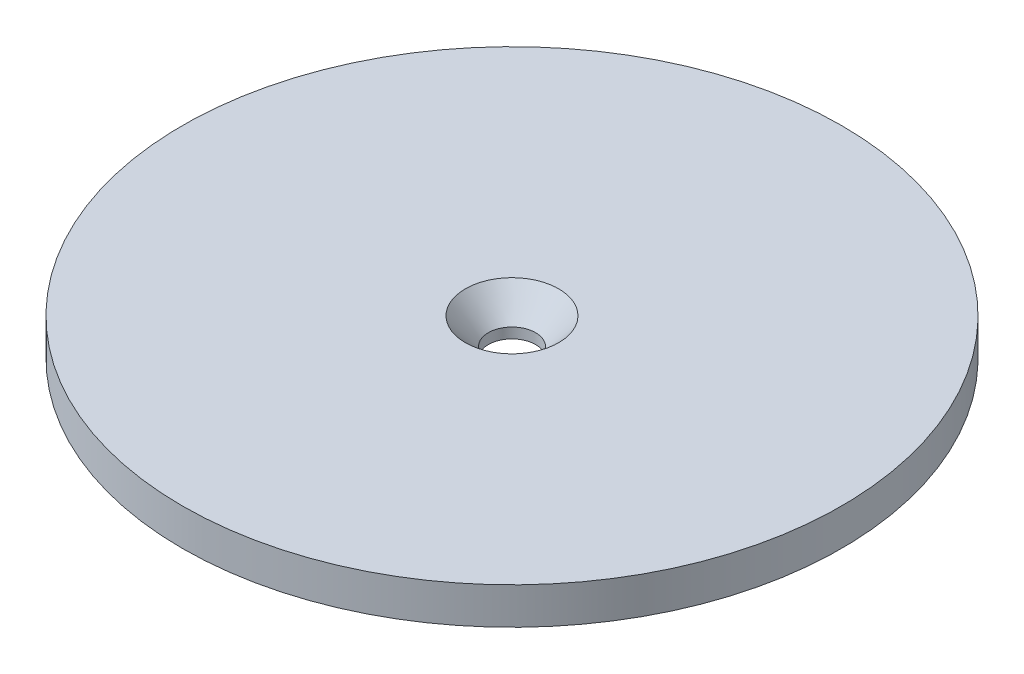
ISO-10303-21;
HEADER;
FILE_DESCRIPTION(('STEP AP214'),'2;1');
FILE_NAME('part.step','',(''),(''),'','','');
FILE_SCHEMA(('AUTOMOTIVE_DESIGN { 1 0 10303 214 1 1 1 1 }'));
ENDSEC;
DATA;
#1=APPLICATION_CONTEXT('core data for automotive mechanical design processes');
#2=APPLICATION_PROTOCOL_DEFINITION('international standard','automotive_design',2000,#1);
#3=PRODUCT_CONTEXT('',#1,'mechanical');
#4=PRODUCT('Part','Part','',(#3));
#5=PRODUCT_RELATED_PRODUCT_CATEGORY('part','',(#4));
#6=PRODUCT_DEFINITION_FORMATION('','',#4);
#7=PRODUCT_DEFINITION_CONTEXT('part definition',#1,'design');
#8=PRODUCT_DEFINITION('design','',#6,#7);
#9=PRODUCT_DEFINITION_SHAPE('','',#8);
#10=(LENGTH_UNIT() NAMED_UNIT(*) SI_UNIT(.MILLI.,.METRE.));
#11=(NAMED_UNIT(*) PLANE_ANGLE_UNIT() SI_UNIT($,.RADIAN.));
#12=(NAMED_UNIT(*) SI_UNIT($,.STERADIAN.) SOLID_ANGLE_UNIT());
#13=UNCERTAINTY_MEASURE_WITH_UNIT(LENGTH_MEASURE(1.E-05),#10,'distance_accuracy_value','');
#14=(GEOMETRIC_REPRESENTATION_CONTEXT(3) GLOBAL_UNCERTAINTY_ASSIGNED_CONTEXT((#13)) GLOBAL_UNIT_ASSIGNED_CONTEXT((#10,
#11,#12)) REPRESENTATION_CONTEXT('',''));
#15=CARTESIAN_POINT('',(0.,0.,0.));
#16=DIRECTION('',(0.,0.,1.));
#17=DIRECTION('',(1.,0.,0.));
#18=AXIS2_PLACEMENT_3D('',#15,#16,#17);
#19=CARTESIAN_POINT('',(0.,25.4,0.));
#20=DIRECTION('',(0.,-1.,0.));
#21=DIRECTION('',(0.,0.,-1.));
#22=AXIS2_PLACEMENT_3D('',#19,#20,#21);
#23=CYLINDRICAL_SURFACE('',#22,45.466);
#24=CARTESIAN_POINT('',(0.,25.4,0.));
#25=DIRECTION('',(0.,1.,0.));
#26=DIRECTION('',(0.,0.,1.));
#27=AXIS2_PLACEMENT_3D('',#24,#25,#26);
#28=CIRCLE('',#27,45.466);
#29=CARTESIAN_POINT('',(0.,25.4,45.466));
#30=VERTEX_POINT('',#29);
#31=EDGE_CURVE('E10',#30,#30,#28,.T.);
#32=ORIENTED_EDGE('',*,*,#31,.F.);
#33=EDGE_LOOP('',(#32));
#34=FACE_BOUND('',#33,.T.);
#35=CARTESIAN_POINT('',(0.,20.322357612504,0.));
#36=DIRECTION('',(0.,-1.,0.));
#37=DIRECTION('',(0.,0.,-1.));
#38=AXIS2_PLACEMENT_3D('',#35,#36,#37);
#39=CIRCLE('',#38,45.466);
#40=CARTESIAN_POINT('',(0.,20.322357612504,-45.466));
#41=VERTEX_POINT('',#40);
#42=EDGE_CURVE('E53',#41,#41,#39,.T.);
#43=ORIENTED_EDGE('',*,*,#42,.F.);
#44=EDGE_LOOP('',(#43));
#45=FACE_BOUND('',#44,.T.);
#46=ADVANCED_FACE('F37',(#34,#45),#23,.T.);
#47=CARTESIAN_POINT('',(0.,25.4,0.));
#48=DIRECTION('',(0.,1.,0.));
#49=DIRECTION('',(0.,0.,1.));
#50=AXIS2_PLACEMENT_3D('',#47,#48,#49);
#51=CYLINDRICAL_SURFACE('',#50,3.26389999999999);
#52=CARTESIAN_POINT('',(0.,21.7475803070733,0.));
#53=DIRECTION('',(0.,1.,0.));
#54=DIRECTION('',(0.,0.,1.));
#55=AXIS2_PLACEMENT_3D('',#52,#53,#54);
#56=CIRCLE('',#55,3.2639);
#57=CARTESIAN_POINT('',(0.,21.7475803070733,3.2639));
#58=VERTEX_POINT('',#57);
#59=EDGE_CURVE('E44',#58,#58,#56,.T.);
#60=ORIENTED_EDGE('',*,*,#59,.T.);
#61=EDGE_LOOP('',(#60));
#62=FACE_BOUND('',#61,.T.);
#63=CARTESIAN_POINT('',(0.,20.322357612504,0.));
#64=DIRECTION('',(0.,-1.,0.));
#65=DIRECTION('',(0.,0.,-1.));
#66=AXIS2_PLACEMENT_3D('',#63,#64,#65);
#67=CIRCLE('',#66,3.26389999999999);
#68=CARTESIAN_POINT('',(0.,20.322357612504,-3.26389999999999));
#69=VERTEX_POINT('',#68);
#70=EDGE_CURVE('E40',#69,#69,#67,.F.);
#71=ORIENTED_EDGE('',*,*,#70,.F.);
#72=EDGE_LOOP('',(#71));
#73=FACE_BOUND('',#72,.T.);
#74=ADVANCED_FACE('F62',(#62,#73),#51,.F.);
#75=CARTESIAN_POINT('',(0.,25.4,0.));
#76=DIRECTION('',(0.,1.,0.));
#77=DIRECTION('',(0.,0.,1.));
#78=AXIS2_PLACEMENT_3D('',#75,#76,#77);
#79=PLANE('',#78);
#80=CARTESIAN_POINT('',(0.,25.4,0.));
#81=DIRECTION('',(0.,1.,0.));
#82=DIRECTION('',(0.,0.,1.));
#83=AXIS2_PLACEMENT_3D('',#80,#81,#82);
#84=CIRCLE('',#83,6.4389);
#85=CARTESIAN_POINT('',(0.,25.4,6.4389));
#86=VERTEX_POINT('',#85);
#87=EDGE_CURVE('E48',#86,#86,#84,.T.);
#88=ORIENTED_EDGE('',*,*,#87,.F.);
#89=EDGE_LOOP('',(#88));
#90=FACE_BOUND('',#89,.T.);
#91=ORIENTED_EDGE('',*,*,#31,.T.);
#92=EDGE_LOOP('',(#91));
#93=FACE_BOUND('',#92,.T.);
#94=ADVANCED_FACE('F64',(#90,#93),#79,.T.);
#95=CARTESIAN_POINT('',(0.,25.4,0.));
#96=DIRECTION('',(0.,1.,0.));
#97=DIRECTION('',(0.,0.,1.));
#98=AXIS2_PLACEMENT_3D('',#95,#96,#97);
#99=CONICAL_SURFACE('',#98,6.4389,0.715584993317675);
#100=ORIENTED_EDGE('',*,*,#59,.F.);
#101=EDGE_LOOP('',(#100));
#102=FACE_BOUND('',#101,.T.);
#103=ORIENTED_EDGE('',*,*,#87,.T.);
#104=EDGE_LOOP('',(#103));
#105=FACE_BOUND('',#104,.T.);
#106=ADVANCED_FACE('F71',(#102,#105),#99,.F.);
#107=CARTESIAN_POINT('',(0.,20.322357612504,0.));
#108=DIRECTION('',(0.,-1.,0.));
#109=DIRECTION('',(0.,0.,-1.));
#110=AXIS2_PLACEMENT_3D('',#107,#108,#109);
#111=PLANE('',#110);
#112=ORIENTED_EDGE('',*,*,#70,.T.);
#113=EDGE_LOOP('',(#112));
#114=FACE_BOUND('',#113,.T.);
#115=ORIENTED_EDGE('',*,*,#42,.T.);
#116=EDGE_LOOP('',(#115));
#117=FACE_BOUND('',#116,.T.);
#118=ADVANCED_FACE('F60',(#114,#117),#111,.T.);
#119=CLOSED_SHELL('',(#46,#74,#94,#106,#118));
#120=MANIFOLD_SOLID_BREP('B2',#119);
#121=ADVANCED_BREP_SHAPE_REPRESENTATION('',(#18,#120),#14);
#122=SHAPE_DEFINITION_REPRESENTATION(#9,#121);
ENDSEC;
END-ISO-10303-21;
